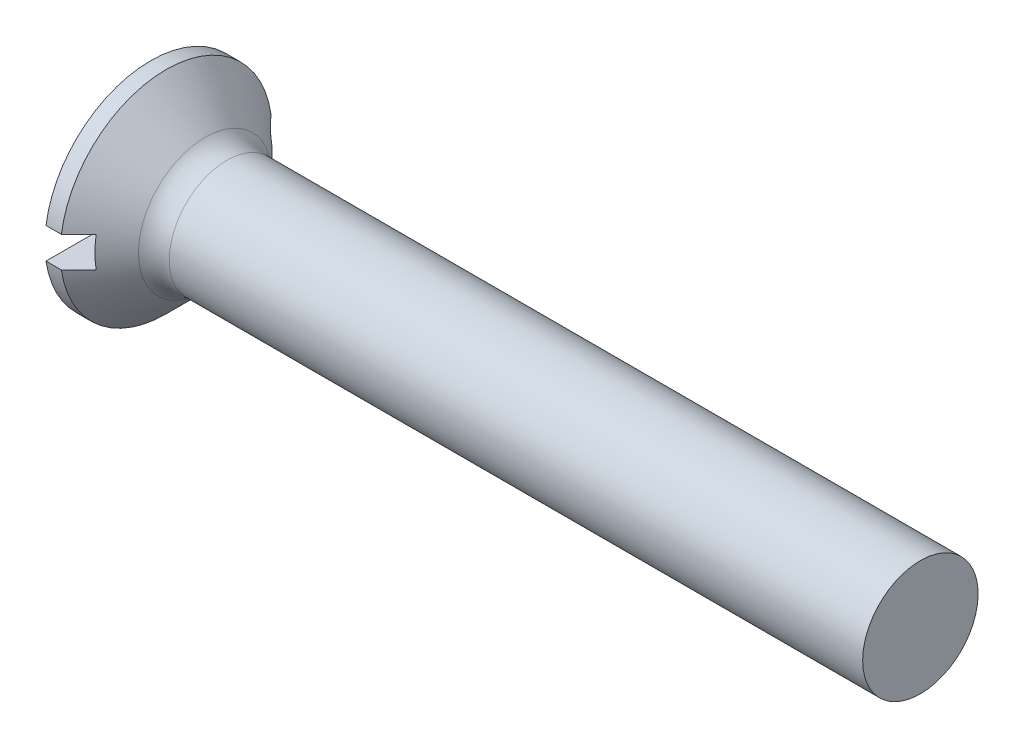
ISO-10303-21;
HEADER;
FILE_DESCRIPTION(('STEP AP214'),'2;1');
FILE_NAME('part.step','',(''),(''),'','','');
FILE_SCHEMA(('AUTOMOTIVE_DESIGN { 1 0 10303 214 1 1 1 1 }'));
ENDSEC;
DATA;
#1=APPLICATION_CONTEXT('core data for automotive mechanical design processes');
#2=APPLICATION_PROTOCOL_DEFINITION('international standard','automotive_design',2000,#1);
#3=PRODUCT_CONTEXT('',#1,'mechanical');
#4=PRODUCT('Part','Part','',(#3));
#5=PRODUCT_RELATED_PRODUCT_CATEGORY('part','',(#4));
#6=PRODUCT_DEFINITION_FORMATION('','',#4);
#7=PRODUCT_DEFINITION_CONTEXT('part definition',#1,'design');
#8=PRODUCT_DEFINITION('design','',#6,#7);
#9=PRODUCT_DEFINITION_SHAPE('','',#8);
#10=(LENGTH_UNIT() NAMED_UNIT(*) SI_UNIT(.MILLI.,.METRE.));
#11=(NAMED_UNIT(*) PLANE_ANGLE_UNIT() SI_UNIT($,.RADIAN.));
#12=(NAMED_UNIT(*) SI_UNIT($,.STERADIAN.) SOLID_ANGLE_UNIT());
#13=UNCERTAINTY_MEASURE_WITH_UNIT(LENGTH_MEASURE(1.E-05),#10,'distance_accuracy_value','');
#14=(GEOMETRIC_REPRESENTATION_CONTEXT(3) GLOBAL_UNCERTAINTY_ASSIGNED_CONTEXT((#13)) GLOBAL_UNIT_ASSIGNED_CONTEXT((#10,
#11,#12)) REPRESENTATION_CONTEXT('',''));
#15=CARTESIAN_POINT('',(0.,0.,0.));
#16=DIRECTION('',(0.,0.,1.));
#17=DIRECTION('',(1.,0.,0.));
#18=AXIS2_PLACEMENT_3D('',#15,#16,#17);
#19=CARTESIAN_POINT('',(0.85,-0.4,-2.75));
#20=DIRECTION('',(1.,0.,0.));
#21=DIRECTION('',(0.,0.,-1.));
#22=AXIS2_PLACEMENT_3D('',#19,#20,#21);
#23=PLANE('',#22);
#24=CARTESIAN_POINT('',(0.850000000045665,0.,0.));
#25=DIRECTION('',(-1.,0.,0.));
#26=DIRECTION('',(0.,0.,1.));
#27=AXIS2_PLACEMENT_3D('',#24,#25,#26);
#28=CIRCLE('',#27,2.29999999999109);
#29=CARTESIAN_POINT('',(0.850000000034848,0.4,2.26495033058316));
#30=VERTEX_POINT('',#29);
#31=CARTESIAN_POINT('',(0.850000000022832,-0.400000000000001,2.26495033059536));
#32=VERTEX_POINT('',#31);
#33=EDGE_CURVE('E81',#30,#32,#28,.F.);
#34=ORIENTED_EDGE('',*,*,#33,.F.);
#35=DIRECTION('',(0.,0.,1.));
#36=VECTOR('',#35,1.);
#37=CARTESIAN_POINT('',(0.85,0.4,2.75));
#38=LINE('',#37,#36);
#39=CARTESIAN_POINT('',(0.850000000022832,0.4,-2.26495033059536));
#40=VERTEX_POINT('',#39);
#41=EDGE_CURVE('E83',#30,#40,#38,.F.);
#42=ORIENTED_EDGE('',*,*,#41,.T.);
#43=CARTESIAN_POINT('',(0.850000000045665,0.,0.));
#44=DIRECTION('',(-1.,0.,0.));
#45=DIRECTION('',(0.,0.,1.));
#46=AXIS2_PLACEMENT_3D('',#43,#44,#45);
#47=CIRCLE('',#46,2.29999999999109);
#48=CARTESIAN_POINT('',(0.850000000034848,-0.400000000000001,-2.26495033058316));
#49=VERTEX_POINT('',#48);
#50=EDGE_CURVE('E19',#49,#40,#47,.F.);
#51=ORIENTED_EDGE('',*,*,#50,.F.);
#52=DIRECTION('',(0.,0.,-1.));
#53=VECTOR('',#52,1.);
#54=CARTESIAN_POINT('',(0.85,-0.4,-2.75));
#55=LINE('',#54,#53);
#56=EDGE_CURVE('E134',#49,#32,#55,.F.);
#57=ORIENTED_EDGE('',*,*,#56,.T.);
#58=EDGE_LOOP('',(#34,#42,#51,#57));
#59=FACE_BOUND('',#58,.T.);
#60=ADVANCED_FACE('F16',(#59),#23,.F.);
#61=CARTESIAN_POINT('',(0.85,-0.4,-2.75));
#62=DIRECTION('',(0.,-1.,0.));
#63=DIRECTION('',(0.,0.,-1.));
#64=AXIS2_PLACEMENT_3D('',#61,#62,#63);
#65=PLANE('',#64);
#66=CARTESIAN_POINT('',(0.85000000002447,-0.400000000000001,2.2649503305937));
#67=CARTESIAN_POINT('',(0.775087851769284,-0.400000000000001,2.34100427520676));
#68=CARTESIAN_POINT('',(0.700131776523775,-0.400000000000001,2.41701485210356));
#69=CARTESIAN_POINT('',(0.550131776521701,-0.400000000000001,2.56894926593744));
#70=CARTESIAN_POINT('',(0.475087851770372,-0.400000000000001,2.64487310287968));
#71=CARTESIAN_POINT('',(0.400000000033955,-0.400000000000001,2.72075357211084));
#72=B_SPLINE_CURVE_WITH_KNOTS('',3,(#66,#67,#68,#69,#70,#71),.UNSPECIFIED.,.F.,.F.,(4,2,4),(0.,
0.320256442788528,0.64051286649153),.UNSPECIFIED.);
#73=CARTESIAN_POINT('',(0.400000000023617,-0.400000000000001,2.7207535720967));
#74=VERTEX_POINT('',#73);
#75=EDGE_CURVE('E125',#32,#74,#72,.T.);
#76=ORIENTED_EDGE('',*,*,#75,.F.);
#77=ORIENTED_EDGE('',*,*,#56,.F.);
#78=CARTESIAN_POINT('',(0.400000000033956,-0.4,-2.72075357211084));
#79=CARTESIAN_POINT('',(0.475087851770298,-0.4,-2.64487310287976));
#80=CARTESIAN_POINT('',(0.550131776521554,-0.4,-2.56894926593759));
#81=CARTESIAN_POINT('',(0.700131776523482,-0.4,-2.41701485210386));
#82=CARTESIAN_POINT('',(0.775087851768917,-0.4,-2.34100427520713));
#83=CARTESIAN_POINT('',(0.850000000024031,-0.4,-2.26495033059414));
#84=B_SPLINE_CURVE_WITH_KNOTS('',3,(#78,#79,#80,#81,#82,#83),.UNSPECIFIED.,.F.,.F.,(4,2,4),(0.,
0.320256423702688,0.640512866490903),.UNSPECIFIED.);
#85=CARTESIAN_POINT('',(0.400000000037608,-0.400000000000001,-2.72075357207842));
#86=VERTEX_POINT('',#85);
#87=EDGE_CURVE('E76',#86,#49,#84,.T.);
#88=ORIENTED_EDGE('',*,*,#87,.F.);
#89=DIRECTION('',(1.,0.,0.));
#90=VECTOR('',#89,1.);
#91=CARTESIAN_POINT('',(0.85,-0.4,-2.72075357208256));
#92=LINE('',#91,#90);
#93=CARTESIAN_POINT('',(0.,-0.400000000000001,-2.72075357208256));
#94=VERTEX_POINT('',#93);
#95=EDGE_CURVE('E135',#94,#86,#92,.T.);
#96=ORIENTED_EDGE('',*,*,#95,.F.);
#97=DIRECTION('',(0.,0.,1.));
#98=VECTOR('',#97,1.);
#99=CARTESIAN_POINT('',(0.,-0.400000000000001,0.));
#100=LINE('',#99,#98);
#101=CARTESIAN_POINT('',(0.,-0.400000000000001,2.72075357208256));
#102=VERTEX_POINT('',#101);
#103=EDGE_CURVE('E97',#102,#94,#100,.F.);
#104=ORIENTED_EDGE('',*,*,#103,.F.);
#105=DIRECTION('',(1.,0.,0.));
#106=VECTOR('',#105,1.);
#107=CARTESIAN_POINT('',(0.85,-0.400000000000001,2.72075357208256));
#108=LINE('',#107,#106);
#109=EDGE_CURVE('E174',#74,#102,#108,.F.);
#110=ORIENTED_EDGE('',*,*,#109,.F.);
#111=EDGE_LOOP('',(#76,#77,#88,#96,#104,#110));
#112=FACE_BOUND('',#111,.T.);
#113=ADVANCED_FACE('F136',(#112),#65,.F.);
#114=CARTESIAN_POINT('',(0.85,0.4,2.75));
#115=DIRECTION('',(0.,1.,0.));
#116=DIRECTION('',(0.,0.,1.));
#117=AXIS2_PLACEMENT_3D('',#114,#115,#116);
#118=PLANE('',#117);
#119=CARTESIAN_POINT('',(0.850000000024469,0.4,-2.2649503305937));
#120=CARTESIAN_POINT('',(0.775087851769283,0.4,-2.34100427520676));
#121=CARTESIAN_POINT('',(0.700131776523775,0.4,-2.41701485210356));
#122=CARTESIAN_POINT('',(0.550131776521701,0.4,-2.56894926593744));
#123=CARTESIAN_POINT('',(0.475087851770372,0.4,-2.64487310287968));
#124=CARTESIAN_POINT('',(0.400000000033955,0.4,-2.72075357211084));
#125=B_SPLINE_CURVE_WITH_KNOTS('',3,(#119,#120,#121,#122,#123,#124),.UNSPECIFIED.,.F.,.F.,(4,2,
4),(0.,0.320256442788528,0.640512866491529),.UNSPECIFIED.);
#126=CARTESIAN_POINT('',(0.400000000023617,0.4,-2.7207535720967));
#127=VERTEX_POINT('',#126);
#128=EDGE_CURVE('E72',#40,#127,#125,.T.);
#129=ORIENTED_EDGE('',*,*,#128,.F.);
#130=ORIENTED_EDGE('',*,*,#41,.F.);
#131=CARTESIAN_POINT('',(0.400000000033956,0.4,2.72075357211084));
#132=CARTESIAN_POINT('',(0.475087851770298,0.4,2.64487310287976));
#133=CARTESIAN_POINT('',(0.550131776521554,0.4,2.56894926593759));
#134=CARTESIAN_POINT('',(0.700131776523482,0.4,2.41701485210386));
#135=CARTESIAN_POINT('',(0.775087851768917,0.4,2.34100427520713));
#136=CARTESIAN_POINT('',(0.850000000024031,0.4,2.26495033059414));
#137=B_SPLINE_CURVE_WITH_KNOTS('',3,(#131,#132,#133,#134,#135,#136),.UNSPECIFIED.,.F.,.F.,(4,2,
4),(0.,0.320256423702688,0.640512866490903),.UNSPECIFIED.);
#138=CARTESIAN_POINT('',(0.400000000037608,0.4,2.72075357207842));
#139=VERTEX_POINT('',#138);
#140=EDGE_CURVE('E86',#139,#30,#137,.T.);
#141=ORIENTED_EDGE('',*,*,#140,.F.);
#142=DIRECTION('',(1.,0.,0.));
#143=VECTOR('',#142,1.);
#144=CARTESIAN_POINT('',(0.85,0.4,2.72075357208256));
#145=LINE('',#144,#143);
#146=CARTESIAN_POINT('',(0.,0.4,2.72075357208256));
#147=VERTEX_POINT('',#146);
#148=EDGE_CURVE('E35',#147,#139,#145,.T.);
#149=ORIENTED_EDGE('',*,*,#148,.F.);
#150=DIRECTION('',(0.,0.,1.));
#151=VECTOR('',#150,1.);
#152=CARTESIAN_POINT('',(0.,0.4,0.));
#153=LINE('',#152,#151);
#154=CARTESIAN_POINT('',(0.,0.4,-2.72075357208256));
#155=VERTEX_POINT('',#154);
#156=EDGE_CURVE('E166',#155,#147,#153,.T.);
#157=ORIENTED_EDGE('',*,*,#156,.F.);
#158=DIRECTION('',(1.,0.,0.));
#159=VECTOR('',#158,1.);
#160=CARTESIAN_POINT('',(0.85,0.4,-2.72075357208256));
#161=LINE('',#160,#159);
#162=EDGE_CURVE('E90',#127,#155,#161,.F.);
#163=ORIENTED_EDGE('',*,*,#162,.F.);
#164=EDGE_LOOP('',(#129,#130,#141,#149,#157,#163));
#165=FACE_BOUND('',#164,.T.);
#166=ADVANCED_FACE('F89',(#165),#118,.F.);
#167=CARTESIAN_POINT('',(0.,0.,0.));
#168=DIRECTION('',(-1.,0.,0.));
#169=DIRECTION('',(0.,0.,1.));
#170=AXIS2_PLACEMENT_3D('',#167,#168,#169);
#171=PLANE('',#170);
#172=ORIENTED_EDGE('',*,*,#103,.T.);
#173=CARTESIAN_POINT('',(0.,0.,0.));
#174=DIRECTION('',(-1.,0.,0.));
#175=DIRECTION('',(0.,0.,1.));
#176=AXIS2_PLACEMENT_3D('',#173,#174,#175);
#177=CIRCLE('',#176,2.75);
#178=EDGE_CURVE('E106',#102,#94,#177,.F.);
#179=ORIENTED_EDGE('',*,*,#178,.F.);
#180=EDGE_LOOP('',(#172,#179));
#181=FACE_BOUND('',#180,.T.);
#182=ADVANCED_FACE('F146',(#181),#171,.T.);
#183=CARTESIAN_POINT('',(0.,0.,0.));
#184=DIRECTION('',(-1.,0.,0.));
#185=DIRECTION('',(0.,0.,1.));
#186=AXIS2_PLACEMENT_3D('',#183,#184,#185);
#187=PLANE('',#186);
#188=ORIENTED_EDGE('',*,*,#156,.T.);
#189=CARTESIAN_POINT('',(0.,0.,0.));
#190=DIRECTION('',(-1.,0.,0.));
#191=DIRECTION('',(0.,0.,1.));
#192=AXIS2_PLACEMENT_3D('',#189,#190,#191);
#193=CIRCLE('',#192,2.75);
#194=EDGE_CURVE('E183',#155,#147,#193,.F.);
#195=ORIENTED_EDGE('',*,*,#194,.F.);
#196=EDGE_LOOP('',(#188,#195));
#197=FACE_BOUND('',#196,.T.);
#198=ADVANCED_FACE('F206',(#197),#187,.T.);
#199=CARTESIAN_POINT('',(-6.34999999999999,0.,0.));
#200=DIRECTION('',(-1.,0.,0.));
#201=DIRECTION('',(0.,0.,1.));
#202=AXIS2_PLACEMENT_3D('',#199,#200,#201);
#203=CYLINDRICAL_SURFACE('',#202,2.75);
#204=ORIENTED_EDGE('',*,*,#95,.T.);
#205=CARTESIAN_POINT('',(0.400000000013279,0.,0.));
#206=DIRECTION('',(-1.,0.,0.));
#207=DIRECTION('',(0.,0.,1.));
#208=AXIS2_PLACEMENT_3D('',#205,#206,#207);
#209=CIRCLE('',#208,2.74999999999181);
#210=EDGE_CURVE('E179',#74,#86,#209,.F.);
#211=ORIENTED_EDGE('',*,*,#210,.F.);
#212=ORIENTED_EDGE('',*,*,#109,.T.);
#213=ORIENTED_EDGE('',*,*,#178,.T.);
#214=EDGE_LOOP('',(#204,#211,#212,#213));
#215=FACE_BOUND('',#214,.T.);
#216=ADVANCED_FACE('F196',(#215),#203,.T.);
#217=CARTESIAN_POINT('',(-6.34999999999999,0.,0.));
#218=DIRECTION('',(-1.,0.,0.));
#219=DIRECTION('',(0.,0.,1.));
#220=AXIS2_PLACEMENT_3D('',#217,#218,#219);
#221=CYLINDRICAL_SURFACE('',#220,2.75);
#222=ORIENTED_EDGE('',*,*,#148,.T.);
#223=CARTESIAN_POINT('',(0.400000000013279,0.,0.));
#224=DIRECTION('',(-1.,0.,0.));
#225=DIRECTION('',(0.,0.,1.));
#226=AXIS2_PLACEMENT_3D('',#223,#224,#225);
#227=CIRCLE('',#226,2.74999999999181);
#228=EDGE_CURVE('E165',#127,#139,#227,.F.);
#229=ORIENTED_EDGE('',*,*,#228,.F.);
#230=ORIENTED_EDGE('',*,*,#162,.T.);
#231=ORIENTED_EDGE('',*,*,#194,.T.);
#232=EDGE_LOOP('',(#222,#229,#230,#231));
#233=FACE_BOUND('',#232,.T.);
#234=ADVANCED_FACE('F119',(#233),#221,.T.);
#235=CARTESIAN_POINT('',(0.399999999956435,0.,0.));
#236=DIRECTION('',(-1.,0.,0.));
#237=DIRECTION('',(0.,0.,1.));
#238=AXIS2_PLACEMENT_3D('',#235,#236,#237);
#239=CONICAL_SURFACE('',#238,2.7500000001055,0.785398163425431);
#240=ORIENTED_EDGE('',*,*,#87,.T.);
#241=ORIENTED_EDGE('',*,*,#50,.T.);
#242=ORIENTED_EDGE('',*,*,#128,.T.);
#243=ORIENTED_EDGE('',*,*,#228,.T.);
#244=ORIENTED_EDGE('',*,*,#140,.T.);
#245=ORIENTED_EDGE('',*,*,#33,.T.);
#246=ORIENTED_EDGE('',*,*,#75,.T.);
#247=ORIENTED_EDGE('',*,*,#210,.T.);
#248=EDGE_LOOP('',(#240,#241,#242,#243,#244,#245,#246,#247));
#249=FACE_BOUND('',#248,.T.);
#250=CARTESIAN_POINT('',(1.41568542494924,0.,0.));
#251=DIRECTION('',(-1.,0.,0.));
#252=DIRECTION('',(0.,0.,1.));
#253=AXIS2_PLACEMENT_3D('',#250,#251,#252);
#254=CIRCLE('',#253,1.73431457505076);
#255=CARTESIAN_POINT('',(1.41568542494924,0.,1.73431457505076));
#256=VERTEX_POINT('',#255);
#257=EDGE_CURVE('E161',#256,#256,#254,.T.);
#258=ORIENTED_EDGE('',*,*,#257,.T.);
#259=EDGE_LOOP('',(#258));
#260=FACE_BOUND('',#259,.T.);
#261=ADVANCED_FACE('F68',(#249,#260),#239,.T.);
#262=CARTESIAN_POINT('',(20.,1.5,0.));
#263=DIRECTION('',(1.,0.,0.));
#264=DIRECTION('',(0.,0.,-1.));
#265=AXIS2_PLACEMENT_3D('',#262,#263,#264);
#266=PLANE('',#265);
#267=CARTESIAN_POINT('',(20.,0.,0.));
#268=DIRECTION('',(-1.,0.,0.));
#269=DIRECTION('',(0.,0.,1.));
#270=AXIS2_PLACEMENT_3D('',#267,#268,#269);
#271=CIRCLE('',#270,1.5);
#272=CARTESIAN_POINT('',(20.,0.,1.5));
#273=VERTEX_POINT('',#272);
#274=EDGE_CURVE('E26',#273,#273,#271,.T.);
#275=ORIENTED_EDGE('',*,*,#274,.F.);
#276=EDGE_LOOP('',(#275));
#277=FACE_BOUND('',#276,.T.);
#278=ADVANCED_FACE('F118',(#277),#266,.T.);
#279=CARTESIAN_POINT('',(1.98137084989848,0.,0.));
#280=DIRECTION('',(-1.,0.,0.));
#281=DIRECTION('',(0.,0.,1.));
#282=AXIS2_PLACEMENT_3D('',#279,#280,#281);
#283=TOROIDAL_SURFACE('',#282,2.3,0.8);
#284=ORIENTED_EDGE('',*,*,#257,.F.);
#285=EDGE_LOOP('',(#284));
#286=FACE_BOUND('',#285,.T.);
#287=CARTESIAN_POINT('',(1.98137084989848,0.,0.));
#288=DIRECTION('',(-1.,0.,0.));
#289=DIRECTION('',(0.,0.,1.));
#290=AXIS2_PLACEMENT_3D('',#287,#288,#289);
#291=CIRCLE('',#290,1.5);
#292=CARTESIAN_POINT('',(1.98137084989848,0.,1.5));
#293=VERTEX_POINT('',#292);
#294=EDGE_CURVE('E11',#293,#293,#291,.F.);
#295=ORIENTED_EDGE('',*,*,#294,.F.);
#296=EDGE_LOOP('',(#295));
#297=FACE_BOUND('',#296,.T.);
#298=ADVANCED_FACE('F150',(#286,#297),#283,.F.);
#299=CARTESIAN_POINT('',(-6.34999999999999,0.,0.));
#300=DIRECTION('',(-1.,0.,0.));
#301=DIRECTION('',(0.,0.,1.));
#302=AXIS2_PLACEMENT_3D('',#299,#300,#301);
#303=CYLINDRICAL_SURFACE('',#302,1.5);
#304=ORIENTED_EDGE('',*,*,#294,.T.);
#305=EDGE_LOOP('',(#304));
#306=FACE_BOUND('',#305,.T.);
#307=ORIENTED_EDGE('',*,*,#274,.T.);
#308=EDGE_LOOP('',(#307));
#309=FACE_BOUND('',#308,.T.);
#310=ADVANCED_FACE('F148',(#306,#309),#303,.T.);
#311=CLOSED_SHELL('',(#60,#113,#166,#182,#198,#216,#234,#261,#278,#298,#310));
#312=MANIFOLD_SOLID_BREP('B1',#311);
#313=ADVANCED_BREP_SHAPE_REPRESENTATION('',(#18,#312),#14);
#314=SHAPE_DEFINITION_REPRESENTATION(#9,#313);
ENDSEC;
END-ISO-10303-21;
